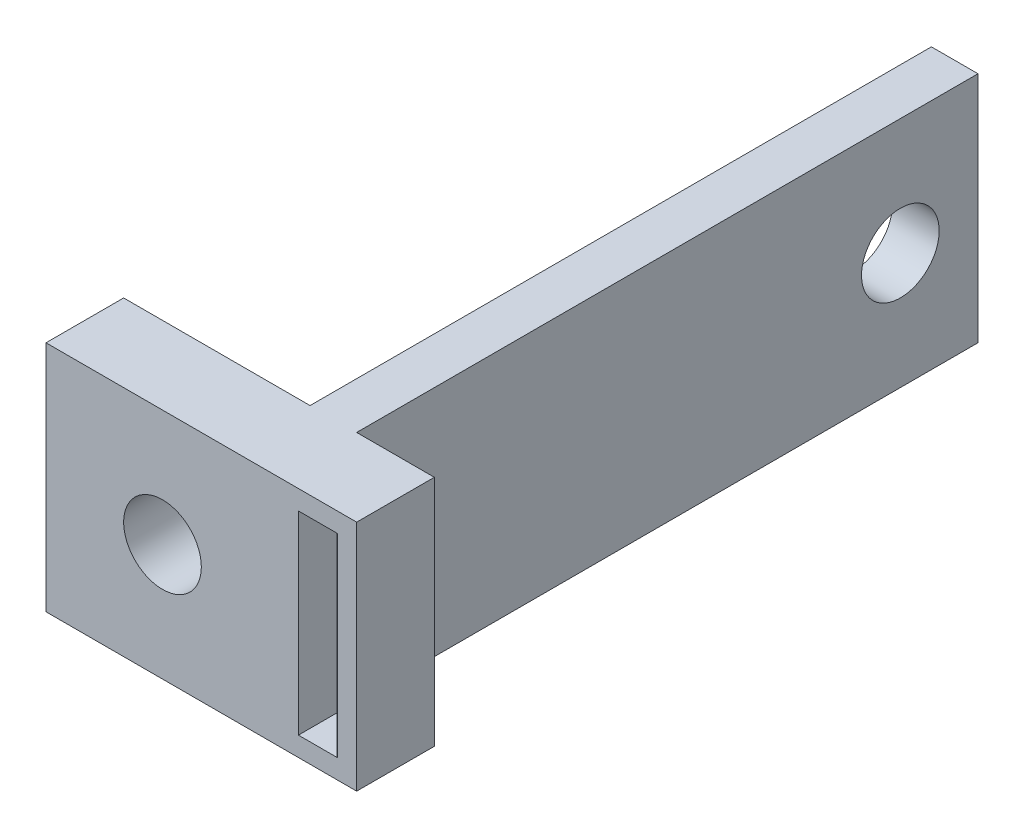
ISO-10303-21;
HEADER;
FILE_DESCRIPTION(('STEP AP214'),'2;1');
FILE_NAME('part.step','',(''),(''),'','','');
FILE_SCHEMA(('AUTOMOTIVE_DESIGN { 1 0 10303 214 1 1 1 1 }'));
ENDSEC;
DATA;
#1=APPLICATION_CONTEXT('core data for automotive mechanical design processes');
#2=APPLICATION_PROTOCOL_DEFINITION('international standard','automotive_design',2000,#1);
#3=PRODUCT_CONTEXT('',#1,'mechanical');
#4=PRODUCT('Part','Part','',(#3));
#5=PRODUCT_RELATED_PRODUCT_CATEGORY('part','',(#4));
#6=PRODUCT_DEFINITION_FORMATION('','',#4);
#7=PRODUCT_DEFINITION_CONTEXT('part definition',#1,'design');
#8=PRODUCT_DEFINITION('design','',#6,#7);
#9=PRODUCT_DEFINITION_SHAPE('','',#8);
#10=(LENGTH_UNIT() NAMED_UNIT(*) SI_UNIT(.MILLI.,.METRE.));
#11=(NAMED_UNIT(*) PLANE_ANGLE_UNIT() SI_UNIT($,.RADIAN.));
#12=(NAMED_UNIT(*) SI_UNIT($,.STERADIAN.) SOLID_ANGLE_UNIT());
#13=UNCERTAINTY_MEASURE_WITH_UNIT(LENGTH_MEASURE(1.E-05),#10,'distance_accuracy_value','');
#14=(GEOMETRIC_REPRESENTATION_CONTEXT(3) GLOBAL_UNCERTAINTY_ASSIGNED_CONTEXT((#13)) GLOBAL_UNIT_ASSIGNED_CONTEXT((#10,
#11,#12)) REPRESENTATION_CONTEXT('',''));
#15=CARTESIAN_POINT('',(0.,0.,0.));
#16=DIRECTION('',(0.,0.,1.));
#17=DIRECTION('',(1.,0.,0.));
#18=AXIS2_PLACEMENT_3D('',#15,#16,#17);
#19=CARTESIAN_POINT('',(0.,0.,0.));
#20=DIRECTION('',(0.,0.,1.));
#21=DIRECTION('',(1.,0.,0.));
#22=AXIS2_PLACEMENT_3D('',#19,#20,#21);
#23=PLANE('',#22);
#24=DIRECTION('',(1.,0.,0.));
#25=VECTOR('',#24,1.);
#26=CARTESIAN_POINT('',(16.25,13.75,0.));
#27=LINE('',#26,#25);
#28=CARTESIAN_POINT('',(16.25,13.75,0.));
#29=VERTEX_POINT('',#28);
#30=CARTESIAN_POINT('',(18.75,13.75,0.));
#31=VERTEX_POINT('',#30);
#32=EDGE_CURVE('E158',#29,#31,#27,.T.);
#33=ORIENTED_EDGE('',*,*,#32,.F.);
#34=DIRECTION('',(0.,1.,0.));
#35=VECTOR('',#34,1.);
#36=CARTESIAN_POINT('',(16.25,13.75,0.));
#37=LINE('',#36,#35);
#38=CARTESIAN_POINT('',(16.25,1.25,0.));
#39=VERTEX_POINT('',#38);
#40=EDGE_CURVE('E55',#39,#29,#37,.T.);
#41=ORIENTED_EDGE('',*,*,#40,.F.);
#42=DIRECTION('',(-1.,0.,0.));
#43=VECTOR('',#42,1.);
#44=CARTESIAN_POINT('',(16.25,1.25,0.));
#45=LINE('',#44,#43);
#46=CARTESIAN_POINT('',(18.75,1.25,0.));
#47=VERTEX_POINT('',#46);
#48=EDGE_CURVE('E147',#47,#39,#45,.T.);
#49=ORIENTED_EDGE('',*,*,#48,.F.);
#50=DIRECTION('',(0.,-1.,0.));
#51=VECTOR('',#50,1.);
#52=CARTESIAN_POINT('',(18.75,13.75,0.));
#53=LINE('',#52,#51);
#54=EDGE_CURVE('E150',#31,#47,#53,.T.);
#55=ORIENTED_EDGE('',*,*,#54,.F.);
#56=EDGE_LOOP('',(#33,#41,#49,#55));
#57=FACE_BOUND('',#56,.T.);
#58=DIRECTION('',(0.,-1.,0.));
#59=VECTOR('',#58,1.);
#60=CARTESIAN_POINT('',(15.,15.,0.));
#61=LINE('',#60,#59);
#62=CARTESIAN_POINT('',(15.,15.,0.));
#63=VERTEX_POINT('',#62);
#64=CARTESIAN_POINT('',(15.,0.,0.));
#65=VERTEX_POINT('',#64);
#66=EDGE_CURVE('E164',#63,#65,#61,.T.);
#67=ORIENTED_EDGE('',*,*,#66,.F.);
#68=DIRECTION('',(1.,0.,0.));
#69=VECTOR('',#68,1.);
#70=CARTESIAN_POINT('',(0.,15.,0.));
#71=LINE('',#70,#69);
#72=CARTESIAN_POINT('',(20.,15.,0.));
#73=VERTEX_POINT('',#72);
#74=EDGE_CURVE('E221',#63,#73,#71,.T.);
#75=ORIENTED_EDGE('',*,*,#74,.T.);
#76=DIRECTION('',(0.,1.,0.));
#77=VECTOR('',#76,1.);
#78=CARTESIAN_POINT('',(20.,0.,0.));
#79=LINE('',#78,#77);
#80=CARTESIAN_POINT('',(20.,0.,0.));
#81=VERTEX_POINT('',#80);
#82=EDGE_CURVE('E218',#81,#73,#79,.T.);
#83=ORIENTED_EDGE('',*,*,#82,.F.);
#84=DIRECTION('',(1.,0.,0.));
#85=VECTOR('',#84,1.);
#86=CARTESIAN_POINT('',(0.,0.,0.));
#87=LINE('',#86,#85);
#88=EDGE_CURVE('E199',#65,#81,#87,.T.);
#89=ORIENTED_EDGE('',*,*,#88,.F.);
#90=EDGE_LOOP('',(#67,#75,#83,#89));
#91=FACE_BOUND('',#90,.T.);
#92=ADVANCED_FACE('F39',(#57,#91),#23,.F.);
#93=CARTESIAN_POINT('',(0.,0.,5.));
#94=DIRECTION('',(0.,1.,0.));
#95=DIRECTION('',(0.,0.,1.));
#96=AXIS2_PLACEMENT_3D('',#93,#94,#95);
#97=PLANE('',#96);
#98=CARTESIAN_POINT('',(0.,0.,0.));
#99=VERTEX_POINT('',#98);
#100=CARTESIAN_POINT('',(12.,0.,0.));
#101=VERTEX_POINT('',#100);
#102=EDGE_CURVE('E215',#99,#101,#87,.T.);
#103=ORIENTED_EDGE('',*,*,#102,.T.);
#104=DIRECTION('',(0.,0.,1.));
#105=VECTOR('',#104,1.);
#106=CARTESIAN_POINT('',(12.,0.,-40.));
#107=LINE('',#106,#105);
#108=CARTESIAN_POINT('',(12.,0.,-40.));
#109=VERTEX_POINT('',#108);
#110=EDGE_CURVE('E186',#109,#101,#107,.T.);
#111=ORIENTED_EDGE('',*,*,#110,.F.);
#112=DIRECTION('',(1.,0.,0.));
#113=VECTOR('',#112,1.);
#114=CARTESIAN_POINT('',(12.,0.,-40.));
#115=LINE('',#114,#113);
#116=CARTESIAN_POINT('',(15.,0.,-40.));
#117=VERTEX_POINT('',#116);
#118=EDGE_CURVE('E174',#109,#117,#115,.T.);
#119=ORIENTED_EDGE('',*,*,#118,.T.);
#120=DIRECTION('',(0.,0.,1.));
#121=VECTOR('',#120,1.);
#122=CARTESIAN_POINT('',(15.,0.,-40.));
#123=LINE('',#122,#121);
#124=EDGE_CURVE('E189',#117,#65,#123,.T.);
#125=ORIENTED_EDGE('',*,*,#124,.T.);
#126=ORIENTED_EDGE('',*,*,#88,.T.);
#127=DIRECTION('',(0.,0.,-1.));
#128=VECTOR('',#127,1.);
#129=CARTESIAN_POINT('',(20.,0.,5.));
#130=LINE('',#129,#128);
#131=CARTESIAN_POINT('',(20.,0.,5.));
#132=VERTEX_POINT('',#131);
#133=EDGE_CURVE('E11',#132,#81,#130,.T.);
#134=ORIENTED_EDGE('',*,*,#133,.F.);
#135=DIRECTION('',(1.,0.,0.));
#136=VECTOR('',#135,1.);
#137=CARTESIAN_POINT('',(0.,0.,5.));
#138=LINE('',#137,#136);
#139=CARTESIAN_POINT('',(0.,0.,5.));
#140=VERTEX_POINT('',#139);
#141=EDGE_CURVE('E202',#140,#132,#138,.T.);
#142=ORIENTED_EDGE('',*,*,#141,.F.);
#143=DIRECTION('',(0.,0.,-1.));
#144=VECTOR('',#143,1.);
#145=CARTESIAN_POINT('',(0.,0.,5.));
#146=LINE('',#145,#144);
#147=EDGE_CURVE('E214',#140,#99,#146,.T.);
#148=ORIENTED_EDGE('',*,*,#147,.T.);
#149=EDGE_LOOP('',(#103,#111,#119,#125,#126,#134,#142,#148));
#150=FACE_BOUND('',#149,.T.);
#151=ADVANCED_FACE('F41',(#150),#97,.F.);
#152=CARTESIAN_POINT('',(20.,0.,5.));
#153=DIRECTION('',(-1.,0.,0.));
#154=DIRECTION('',(0.,0.,1.));
#155=AXIS2_PLACEMENT_3D('',#152,#153,#154);
#156=PLANE('',#155);
#157=ORIENTED_EDGE('',*,*,#82,.T.);
#158=DIRECTION('',(0.,0.,-1.));
#159=VECTOR('',#158,1.);
#160=CARTESIAN_POINT('',(20.,15.,5.));
#161=LINE('',#160,#159);
#162=CARTESIAN_POINT('',(20.,15.,5.));
#163=VERTEX_POINT('',#162);
#164=EDGE_CURVE('E48',#163,#73,#161,.T.);
#165=ORIENTED_EDGE('',*,*,#164,.F.);
#166=DIRECTION('',(0.,1.,0.));
#167=VECTOR('',#166,1.);
#168=CARTESIAN_POINT('',(20.,0.,5.));
#169=LINE('',#168,#167);
#170=EDGE_CURVE('E205',#132,#163,#169,.T.);
#171=ORIENTED_EDGE('',*,*,#170,.F.);
#172=ORIENTED_EDGE('',*,*,#133,.T.);
#173=EDGE_LOOP('',(#157,#165,#171,#172));
#174=FACE_BOUND('',#173,.T.);
#175=ADVANCED_FACE('F239',(#174),#156,.F.);
#176=CARTESIAN_POINT('',(0.,15.,5.));
#177=DIRECTION('',(0.,1.,0.));
#178=DIRECTION('',(0.,0.,1.));
#179=AXIS2_PLACEMENT_3D('',#176,#177,#178);
#180=PLANE('',#179);
#181=CARTESIAN_POINT('',(0.,15.,0.));
#182=VERTEX_POINT('',#181);
#183=CARTESIAN_POINT('',(12.,15.,0.));
#184=VERTEX_POINT('',#183);
#185=EDGE_CURVE('E222',#182,#184,#71,.T.);
#186=ORIENTED_EDGE('',*,*,#185,.F.);
#187=DIRECTION('',(0.,0.,-1.));
#188=VECTOR('',#187,1.);
#189=CARTESIAN_POINT('',(0.,15.,5.));
#190=LINE('',#189,#188);
#191=CARTESIAN_POINT('',(0.,15.,5.));
#192=VERTEX_POINT('',#191);
#193=EDGE_CURVE('E227',#192,#182,#190,.T.);
#194=ORIENTED_EDGE('',*,*,#193,.F.);
#195=DIRECTION('',(1.,0.,0.));
#196=VECTOR('',#195,1.);
#197=CARTESIAN_POINT('',(0.,15.,5.));
#198=LINE('',#197,#196);
#199=EDGE_CURVE('E208',#192,#163,#198,.T.);
#200=ORIENTED_EDGE('',*,*,#199,.T.);
#201=ORIENTED_EDGE('',*,*,#164,.T.);
#202=ORIENTED_EDGE('',*,*,#74,.F.);
#203=DIRECTION('',(0.,0.,1.));
#204=VECTOR('',#203,1.);
#205=CARTESIAN_POINT('',(15.,15.,-40.));
#206=LINE('',#205,#204);
#207=CARTESIAN_POINT('',(15.,15.,-40.));
#208=VERTEX_POINT('',#207);
#209=EDGE_CURVE('E192',#208,#63,#206,.T.);
#210=ORIENTED_EDGE('',*,*,#209,.F.);
#211=DIRECTION('',(1.,0.,0.));
#212=VECTOR('',#211,1.);
#213=CARTESIAN_POINT('',(12.,15.,-40.));
#214=LINE('',#213,#212);
#215=CARTESIAN_POINT('',(12.,15.,-40.));
#216=VERTEX_POINT('',#215);
#217=EDGE_CURVE('E168',#216,#208,#214,.T.);
#218=ORIENTED_EDGE('',*,*,#217,.F.);
#219=DIRECTION('',(0.,0.,1.));
#220=VECTOR('',#219,1.);
#221=CARTESIAN_POINT('',(12.,15.,-40.));
#222=LINE('',#221,#220);
#223=EDGE_CURVE('E180',#216,#184,#222,.T.);
#224=ORIENTED_EDGE('',*,*,#223,.T.);
#225=EDGE_LOOP('',(#186,#194,#200,#201,#202,#210,#218,#224));
#226=FACE_BOUND('',#225,.T.);
#227=ADVANCED_FACE('F234',(#226),#180,.T.);
#228=CARTESIAN_POINT('',(0.,0.,5.));
#229=DIRECTION('',(-1.,0.,0.));
#230=DIRECTION('',(0.,0.,1.));
#231=AXIS2_PLACEMENT_3D('',#228,#229,#230);
#232=PLANE('',#231);
#233=DIRECTION('',(0.,1.,0.));
#234=VECTOR('',#233,1.);
#235=CARTESIAN_POINT('',(0.,0.,0.));
#236=LINE('',#235,#234);
#237=EDGE_CURVE('E206',#99,#182,#236,.T.);
#238=ORIENTED_EDGE('',*,*,#237,.F.);
#239=ORIENTED_EDGE('',*,*,#147,.F.);
#240=DIRECTION('',(0.,1.,0.));
#241=VECTOR('',#240,1.);
#242=CARTESIAN_POINT('',(0.,0.,5.));
#243=LINE('',#242,#241);
#244=EDGE_CURVE('E211',#140,#192,#243,.T.);
#245=ORIENTED_EDGE('',*,*,#244,.T.);
#246=ORIENTED_EDGE('',*,*,#193,.T.);
#247=EDGE_LOOP('',(#238,#239,#245,#246));
#248=FACE_BOUND('',#247,.T.);
#249=ADVANCED_FACE('F261',(#248),#232,.T.);
#250=CARTESIAN_POINT('',(0.,0.,5.));
#251=DIRECTION('',(0.,0.,1.));
#252=DIRECTION('',(1.,0.,0.));
#253=AXIS2_PLACEMENT_3D('',#250,#251,#252);
#254=PLANE('',#253);
#255=DIRECTION('',(0.,1.,0.));
#256=VECTOR('',#255,1.);
#257=CARTESIAN_POINT('',(16.25,13.75,5.));
#258=LINE('',#257,#256);
#259=CARTESIAN_POINT('',(16.25,1.25,5.));
#260=VERTEX_POINT('',#259);
#261=CARTESIAN_POINT('',(16.25,13.75,5.));
#262=VERTEX_POINT('',#261);
#263=EDGE_CURVE('E131',#260,#262,#258,.T.);
#264=ORIENTED_EDGE('',*,*,#263,.T.);
#265=DIRECTION('',(1.,0.,0.));
#266=VECTOR('',#265,1.);
#267=CARTESIAN_POINT('',(16.25,13.75,5.));
#268=LINE('',#267,#266);
#269=CARTESIAN_POINT('',(18.75,13.75,5.));
#270=VERTEX_POINT('',#269);
#271=EDGE_CURVE('E140',#262,#270,#268,.T.);
#272=ORIENTED_EDGE('',*,*,#271,.T.);
#273=DIRECTION('',(0.,-1.,0.));
#274=VECTOR('',#273,1.);
#275=CARTESIAN_POINT('',(18.75,13.75,5.));
#276=LINE('',#275,#274);
#277=CARTESIAN_POINT('',(18.75,1.25,5.));
#278=VERTEX_POINT('',#277);
#279=EDGE_CURVE('E63',#270,#278,#276,.T.);
#280=ORIENTED_EDGE('',*,*,#279,.T.);
#281=DIRECTION('',(-1.,0.,0.));
#282=VECTOR('',#281,1.);
#283=CARTESIAN_POINT('',(16.25,1.25,5.));
#284=LINE('',#283,#282);
#285=EDGE_CURVE('E137',#278,#260,#284,.T.);
#286=ORIENTED_EDGE('',*,*,#285,.T.);
#287=EDGE_LOOP('',(#264,#272,#280,#286));
#288=FACE_BOUND('',#287,.T.);
#289=CARTESIAN_POINT('',(7.5,7.5,5.));
#290=DIRECTION('',(0.,0.,1.));
#291=DIRECTION('',(1.,0.,0.));
#292=AXIS2_PLACEMENT_3D('',#289,#290,#291);
#293=CIRCLE('',#292,2.5);
#294=CARTESIAN_POINT('',(10.,7.5,5.));
#295=VERTEX_POINT('',#294);
#296=EDGE_CURVE('E195',#295,#295,#293,.T.);
#297=ORIENTED_EDGE('',*,*,#296,.F.);
#298=EDGE_LOOP('',(#297));
#299=FACE_BOUND('',#298,.T.);
#300=ORIENTED_EDGE('',*,*,#141,.T.);
#301=ORIENTED_EDGE('',*,*,#170,.T.);
#302=ORIENTED_EDGE('',*,*,#199,.F.);
#303=ORIENTED_EDGE('',*,*,#244,.F.);
#304=EDGE_LOOP('',(#300,#301,#302,#303));
#305=FACE_BOUND('',#304,.T.);
#306=ADVANCED_FACE('F144',(#288,#299,#305),#254,.T.);
#307=CARTESIAN_POINT('',(7.5,7.5,0.));
#308=DIRECTION('',(0.,0.,1.));
#309=DIRECTION('',(1.,0.,0.));
#310=AXIS2_PLACEMENT_3D('',#307,#308,#309);
#311=CIRCLE('',#310,2.5);
#312=CARTESIAN_POINT('',(10.,7.5,0.));
#313=VERTEX_POINT('',#312);
#314=EDGE_CURVE('E196',#313,#313,#311,.T.);
#315=ORIENTED_EDGE('',*,*,#314,.T.);
#316=EDGE_LOOP('',(#315));
#317=FACE_BOUND('',#316,.T.);
#318=ORIENTED_EDGE('',*,*,#185,.T.);
#319=DIRECTION('',(0.,-1.,0.));
#320=VECTOR('',#319,1.);
#321=CARTESIAN_POINT('',(12.,15.,0.));
#322=LINE('',#321,#320);
#323=EDGE_CURVE('E172',#184,#101,#322,.T.);
#324=ORIENTED_EDGE('',*,*,#323,.T.);
#325=ORIENTED_EDGE('',*,*,#102,.F.);
#326=ORIENTED_EDGE('',*,*,#237,.T.);
#327=EDGE_LOOP('',(#318,#324,#325,#326));
#328=FACE_BOUND('',#327,.T.);
#329=ADVANCED_FACE('F255',(#317,#328),#23,.F.);
#330=CARTESIAN_POINT('',(7.5,7.5,0.));
#331=DIRECTION('',(0.,0.,1.));
#332=DIRECTION('',(1.,0.,0.));
#333=AXIS2_PLACEMENT_3D('',#330,#331,#332);
#334=CYLINDRICAL_SURFACE('',#333,2.5);
#335=ORIENTED_EDGE('',*,*,#314,.F.);
#336=EDGE_LOOP('',(#335));
#337=FACE_BOUND('',#336,.T.);
#338=ORIENTED_EDGE('',*,*,#296,.T.);
#339=EDGE_LOOP('',(#338));
#340=FACE_BOUND('',#339,.T.);
#341=ADVANCED_FACE('F270',(#337,#340),#334,.F.);
#342=CARTESIAN_POINT('',(15.,15.,-40.));
#343=DIRECTION('',(-1.,0.,0.));
#344=DIRECTION('',(0.,-1.,0.));
#345=AXIS2_PLACEMENT_3D('',#342,#343,#344);
#346=PLANE('',#345);
#347=CARTESIAN_POINT('',(15.,7.5,-35.));
#348=DIRECTION('',(1.,0.,0.));
#349=DIRECTION('',(0.,1.,0.));
#350=AXIS2_PLACEMENT_3D('',#347,#348,#349);
#351=CIRCLE('',#350,2.5);
#352=CARTESIAN_POINT('',(15.,10.,-35.));
#353=VERTEX_POINT('',#352);
#354=EDGE_CURVE('E153',#353,#353,#351,.T.);
#355=ORIENTED_EDGE('',*,*,#354,.F.);
#356=EDGE_LOOP('',(#355));
#357=FACE_BOUND('',#356,.T.);
#358=ORIENTED_EDGE('',*,*,#66,.T.);
#359=ORIENTED_EDGE('',*,*,#124,.F.);
#360=DIRECTION('',(0.,-1.,0.));
#361=VECTOR('',#360,1.);
#362=CARTESIAN_POINT('',(15.,15.,-40.));
#363=LINE('',#362,#361);
#364=EDGE_CURVE('E171',#208,#117,#363,.T.);
#365=ORIENTED_EDGE('',*,*,#364,.F.);
#366=ORIENTED_EDGE('',*,*,#209,.T.);
#367=EDGE_LOOP('',(#358,#359,#365,#366));
#368=FACE_BOUND('',#367,.T.);
#369=ADVANCED_FACE('F244',(#357,#368),#346,.F.);
#370=CARTESIAN_POINT('',(12.,15.,-40.));
#371=DIRECTION('',(-1.,0.,0.));
#372=DIRECTION('',(0.,-1.,0.));
#373=AXIS2_PLACEMENT_3D('',#370,#371,#372);
#374=PLANE('',#373);
#375=CARTESIAN_POINT('',(12.,7.5,-35.));
#376=DIRECTION('',(-1.,0.,0.));
#377=DIRECTION('',(0.,-1.,0.));
#378=AXIS2_PLACEMENT_3D('',#375,#376,#377);
#379=CIRCLE('',#378,2.5);
#380=CARTESIAN_POINT('',(12.,5.,-35.));
#381=VERTEX_POINT('',#380);
#382=EDGE_CURVE('E43',#381,#381,#379,.T.);
#383=ORIENTED_EDGE('',*,*,#382,.F.);
#384=EDGE_LOOP('',(#383));
#385=FACE_BOUND('',#384,.T.);
#386=ORIENTED_EDGE('',*,*,#323,.F.);
#387=ORIENTED_EDGE('',*,*,#223,.F.);
#388=DIRECTION('',(0.,-1.,0.));
#389=VECTOR('',#388,1.);
#390=CARTESIAN_POINT('',(12.,15.,-40.));
#391=LINE('',#390,#389);
#392=EDGE_CURVE('E177',#216,#109,#391,.T.);
#393=ORIENTED_EDGE('',*,*,#392,.T.);
#394=ORIENTED_EDGE('',*,*,#110,.T.);
#395=EDGE_LOOP('',(#386,#387,#393,#394));
#396=FACE_BOUND('',#395,.T.);
#397=ADVANCED_FACE('F252',(#385,#396),#374,.T.);
#398=CARTESIAN_POINT('',(0.,0.,-40.));
#399=DIRECTION('',(0.,0.,-1.));
#400=DIRECTION('',(-1.,0.,0.));
#401=AXIS2_PLACEMENT_3D('',#398,#399,#400);
#402=PLANE('',#401);
#403=ORIENTED_EDGE('',*,*,#217,.T.);
#404=ORIENTED_EDGE('',*,*,#364,.T.);
#405=ORIENTED_EDGE('',*,*,#118,.F.);
#406=ORIENTED_EDGE('',*,*,#392,.F.);
#407=EDGE_LOOP('',(#403,#404,#405,#406));
#408=FACE_BOUND('',#407,.T.);
#409=ADVANCED_FACE('F250',(#408),#402,.T.);
#410=CARTESIAN_POINT('',(16.25,13.75,5.));
#411=DIRECTION('',(-1.,0.,0.));
#412=DIRECTION('',(0.,0.,1.));
#413=AXIS2_PLACEMENT_3D('',#410,#411,#412);
#414=PLANE('',#413);
#415=ORIENTED_EDGE('',*,*,#40,.T.);
#416=DIRECTION('',(0.,0.,-1.));
#417=VECTOR('',#416,1.);
#418=CARTESIAN_POINT('',(16.25,13.75,5.));
#419=LINE('',#418,#417);
#420=EDGE_CURVE('E127',#262,#29,#419,.T.);
#421=ORIENTED_EDGE('',*,*,#420,.F.);
#422=ORIENTED_EDGE('',*,*,#263,.F.);
#423=DIRECTION('',(0.,0.,-1.));
#424=VECTOR('',#423,1.);
#425=CARTESIAN_POINT('',(16.25,1.25,5.));
#426=LINE('',#425,#424);
#427=EDGE_CURVE('E162',#260,#39,#426,.T.);
#428=ORIENTED_EDGE('',*,*,#427,.T.);
#429=EDGE_LOOP('',(#415,#421,#422,#428));
#430=FACE_BOUND('',#429,.T.);
#431=ADVANCED_FACE('F129',(#430),#414,.F.);
#432=CARTESIAN_POINT('',(16.25,1.25,5.));
#433=DIRECTION('',(0.,-1.,0.));
#434=DIRECTION('',(0.,0.,-1.));
#435=AXIS2_PLACEMENT_3D('',#432,#433,#434);
#436=PLANE('',#435);
#437=ORIENTED_EDGE('',*,*,#48,.T.);
#438=ORIENTED_EDGE('',*,*,#427,.F.);
#439=ORIENTED_EDGE('',*,*,#285,.F.);
#440=DIRECTION('',(0.,0.,-1.));
#441=VECTOR('',#440,1.);
#442=CARTESIAN_POINT('',(18.75,1.25,5.));
#443=LINE('',#442,#441);
#444=EDGE_CURVE('E165',#278,#47,#443,.T.);
#445=ORIENTED_EDGE('',*,*,#444,.T.);
#446=EDGE_LOOP('',(#437,#438,#439,#445));
#447=FACE_BOUND('',#446,.T.);
#448=ADVANCED_FACE('F335',(#447),#436,.F.);
#449=CARTESIAN_POINT('',(18.75,13.75,5.));
#450=DIRECTION('',(1.,0.,0.));
#451=DIRECTION('',(0.,0.,-1.));
#452=AXIS2_PLACEMENT_3D('',#449,#450,#451);
#453=PLANE('',#452);
#454=ORIENTED_EDGE('',*,*,#54,.T.);
#455=ORIENTED_EDGE('',*,*,#444,.F.);
#456=ORIENTED_EDGE('',*,*,#279,.F.);
#457=DIRECTION('',(0.,0.,-1.));
#458=VECTOR('',#457,1.);
#459=CARTESIAN_POINT('',(18.75,13.75,5.));
#460=LINE('',#459,#458);
#461=EDGE_CURVE('E136',#270,#31,#460,.T.);
#462=ORIENTED_EDGE('',*,*,#461,.T.);
#463=EDGE_LOOP('',(#454,#455,#456,#462));
#464=FACE_BOUND('',#463,.T.);
#465=ADVANCED_FACE('F344',(#464),#453,.F.);
#466=CARTESIAN_POINT('',(16.25,13.75,5.));
#467=DIRECTION('',(0.,1.,0.));
#468=DIRECTION('',(0.,0.,1.));
#469=AXIS2_PLACEMENT_3D('',#466,#467,#468);
#470=PLANE('',#469);
#471=ORIENTED_EDGE('',*,*,#32,.T.);
#472=ORIENTED_EDGE('',*,*,#461,.F.);
#473=ORIENTED_EDGE('',*,*,#271,.F.);
#474=ORIENTED_EDGE('',*,*,#420,.T.);
#475=EDGE_LOOP('',(#471,#472,#473,#474));
#476=FACE_BOUND('',#475,.T.);
#477=ADVANCED_FACE('F141',(#476),#470,.F.);
#478=CARTESIAN_POINT('',(5.,7.5,-35.));
#479=DIRECTION('',(1.,0.,0.));
#480=DIRECTION('',(0.,1.,0.));
#481=AXIS2_PLACEMENT_3D('',#478,#479,#480);
#482=CYLINDRICAL_SURFACE('',#481,2.5);
#483=ORIENTED_EDGE('',*,*,#382,.T.);
#484=EDGE_LOOP('',(#483));
#485=FACE_BOUND('',#484,.T.);
#486=ORIENTED_EDGE('',*,*,#354,.T.);
#487=EDGE_LOOP('',(#486));
#488=FACE_BOUND('',#487,.T.);
#489=ADVANCED_FACE('F362',(#485,#488),#482,.F.);
#490=CLOSED_SHELL('',(#92,#151,#175,#227,#249,#306,#329,#341,#369,#397,#409,#431,#448,#465,#477,#489));
#491=MANIFOLD_SOLID_BREP('B2',#490);
#492=ADVANCED_BREP_SHAPE_REPRESENTATION('',(#18,#491),#14);
#493=SHAPE_DEFINITION_REPRESENTATION(#9,#492);
ENDSEC;
END-ISO-10303-21;
